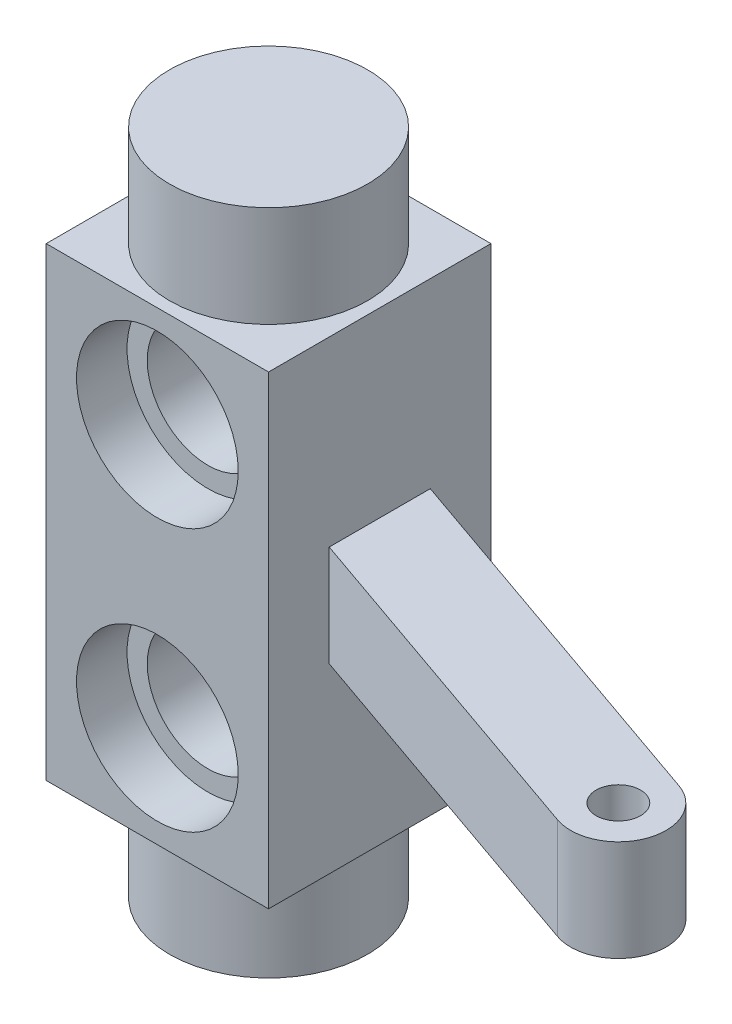
ISO-10303-21;
HEADER;
FILE_DESCRIPTION(('STEP AP214'),'2;1');
FILE_NAME('part.step','',(''),(''),'','','');
FILE_SCHEMA(('AUTOMOTIVE_DESIGN { 1 0 10303 214 1 1 1 1 }'));
ENDSEC;
DATA;
#1=APPLICATION_CONTEXT('core data for automotive mechanical design processes');
#2=APPLICATION_PROTOCOL_DEFINITION('international standard','automotive_design',2000,#1);
#3=PRODUCT_CONTEXT('',#1,'mechanical');
#4=PRODUCT('Part','Part','',(#3));
#5=PRODUCT_RELATED_PRODUCT_CATEGORY('part','',(#4));
#6=PRODUCT_DEFINITION_FORMATION('','',#4);
#7=PRODUCT_DEFINITION_CONTEXT('part definition',#1,'design');
#8=PRODUCT_DEFINITION('design','',#6,#7);
#9=PRODUCT_DEFINITION_SHAPE('','',#8);
#10=(LENGTH_UNIT() NAMED_UNIT(*) SI_UNIT(.MILLI.,.METRE.));
#11=(NAMED_UNIT(*) PLANE_ANGLE_UNIT() SI_UNIT($,.RADIAN.));
#12=(NAMED_UNIT(*) SI_UNIT($,.STERADIAN.) SOLID_ANGLE_UNIT());
#13=UNCERTAINTY_MEASURE_WITH_UNIT(LENGTH_MEASURE(1.E-05),#10,'distance_accuracy_value','');
#14=(GEOMETRIC_REPRESENTATION_CONTEXT(3) GLOBAL_UNCERTAINTY_ASSIGNED_CONTEXT((#13)) GLOBAL_UNIT_ASSIGNED_CONTEXT((#10,
#11,#12)) REPRESENTATION_CONTEXT('',''));
#15=CARTESIAN_POINT('',(0.,0.,0.));
#16=DIRECTION('',(0.,0.,1.));
#17=DIRECTION('',(1.,0.,0.));
#18=AXIS2_PLACEMENT_3D('',#15,#16,#17);
#19=CARTESIAN_POINT('',(5.5,28.,5.5));
#20=DIRECTION('',(-1.,0.,0.));
#21=DIRECTION('',(0.,0.,1.));
#22=AXIS2_PLACEMENT_3D('',#19,#20,#21);
#23=PLANE('',#22);
#24=DIRECTION('',(0.,0.,-1.));
#25=VECTOR('',#24,1.);
#26=CARTESIAN_POINT('',(5.5,5.,5.5));
#27=LINE('',#26,#25);
#28=CARTESIAN_POINT('',(5.5,5.,5.5));
#29=VERTEX_POINT('',#28);
#30=CARTESIAN_POINT('',(5.5,5.,-5.5));
#31=VERTEX_POINT('',#30);
#32=EDGE_CURVE('E183',#29,#31,#27,.T.);
#33=ORIENTED_EDGE('',*,*,#32,.T.);
#34=DIRECTION('',(0.,-1.,0.));
#35=VECTOR('',#34,1.);
#36=CARTESIAN_POINT('',(5.5,28.,-5.5));
#37=LINE('',#36,#35);
#38=CARTESIAN_POINT('',(5.5,28.,-5.5));
#39=VERTEX_POINT('',#38);
#40=EDGE_CURVE('E218',#39,#31,#37,.T.);
#41=ORIENTED_EDGE('',*,*,#40,.F.);
#42=DIRECTION('',(0.,0.,-1.));
#43=VECTOR('',#42,1.);
#44=CARTESIAN_POINT('',(5.5,28.,5.5));
#45=LINE('',#44,#43);
#46=CARTESIAN_POINT('',(5.5,28.,5.5));
#47=VERTEX_POINT('',#46);
#48=EDGE_CURVE('E187',#47,#39,#45,.T.);
#49=ORIENTED_EDGE('',*,*,#48,.F.);
#50=DIRECTION('',(0.,-1.,0.));
#51=VECTOR('',#50,1.);
#52=CARTESIAN_POINT('',(5.5,28.,5.5));
#53=LINE('',#52,#51);
#54=EDGE_CURVE('E197',#47,#29,#53,.T.);
#55=ORIENTED_EDGE('',*,*,#54,.T.);
#56=EDGE_LOOP('',(#33,#41,#49,#55));
#57=FACE_BOUND('',#56,.T.);
#58=DIRECTION('',(0.,0.,-1.));
#59=VECTOR('',#58,1.);
#60=CARTESIAN_POINT('',(5.5,14.,0.));
#61=LINE('',#60,#59);
#62=CARTESIAN_POINT('',(5.5,14.,2.5));
#63=VERTEX_POINT('',#62);
#64=CARTESIAN_POINT('',(5.5,14.,-2.5));
#65=VERTEX_POINT('',#64);
#66=EDGE_CURVE('E63',#63,#65,#61,.T.);
#67=ORIENTED_EDGE('',*,*,#66,.F.);
#68=DIRECTION('',(0.,-1.,0.));
#69=VECTOR('',#68,1.);
#70=CARTESIAN_POINT('',(5.5,19.,2.5));
#71=LINE('',#70,#69);
#72=CARTESIAN_POINT('',(5.5,19.,2.5));
#73=VERTEX_POINT('',#72);
#74=EDGE_CURVE('E365',#73,#63,#71,.T.);
#75=ORIENTED_EDGE('',*,*,#74,.F.);
#76=DIRECTION('',(0.,0.,-1.));
#77=VECTOR('',#76,1.);
#78=CARTESIAN_POINT('',(5.5,19.,0.));
#79=LINE('',#78,#77);
#80=CARTESIAN_POINT('',(5.5,19.,-2.5));
#81=VERTEX_POINT('',#80);
#82=EDGE_CURVE('E143',#73,#81,#79,.T.);
#83=ORIENTED_EDGE('',*,*,#82,.T.);
#84=DIRECTION('',(0.,-1.,0.));
#85=VECTOR('',#84,1.);
#86=CARTESIAN_POINT('',(5.5,19.,-2.5));
#87=LINE('',#86,#85);
#88=EDGE_CURVE('E159',#81,#65,#87,.T.);
#89=ORIENTED_EDGE('',*,*,#88,.T.);
#90=EDGE_LOOP('',(#67,#75,#83,#89));
#91=FACE_BOUND('',#90,.T.);
#92=ADVANCED_FACE('F45',(#57,#91),#23,.F.);
#93=CARTESIAN_POINT('',(0.,5.,0.));
#94=DIRECTION('',(0.,-1.,0.));
#95=DIRECTION('',(0.,0.,-1.));
#96=AXIS2_PLACEMENT_3D('',#93,#94,#95);
#97=CYLINDRICAL_SURFACE('',#96,4.9);
#98=CARTESIAN_POINT('',(0.,5.,0.));
#99=DIRECTION('',(0.,1.,0.));
#100=DIRECTION('',(0.,0.,1.));
#101=AXIS2_PLACEMENT_3D('',#98,#99,#100);
#102=CIRCLE('',#101,4.9);
#103=CARTESIAN_POINT('',(0.,5.,4.9));
#104=VERTEX_POINT('',#103);
#105=EDGE_CURVE('E55',#104,#104,#102,.T.);
#106=ORIENTED_EDGE('',*,*,#105,.F.);
#107=EDGE_LOOP('',(#106));
#108=FACE_BOUND('',#107,.T.);
#109=CARTESIAN_POINT('',(0.,0.,0.));
#110=DIRECTION('',(0.,1.,0.));
#111=DIRECTION('',(0.,0.,1.));
#112=AXIS2_PLACEMENT_3D('',#109,#110,#111);
#113=CIRCLE('',#112,4.9);
#114=CARTESIAN_POINT('',(0.,0.,4.9));
#115=VERTEX_POINT('',#114);
#116=EDGE_CURVE('E49',#115,#115,#113,.T.);
#117=ORIENTED_EDGE('',*,*,#116,.T.);
#118=EDGE_LOOP('',(#117));
#119=FACE_BOUND('',#118,.T.);
#120=ADVANCED_FACE('F47',(#108,#119),#97,.T.);
#121=CARTESIAN_POINT('',(0.,0.,0.));
#122=DIRECTION('',(0.,1.,0.));
#123=DIRECTION('',(0.,0.,1.));
#124=AXIS2_PLACEMENT_3D('',#121,#122,#123);
#125=PLANE('',#124);
#126=ORIENTED_EDGE('',*,*,#116,.F.);
#127=EDGE_LOOP('',(#126));
#128=FACE_BOUND('',#127,.T.);
#129=ADVANCED_FACE('F229',(#128),#125,.F.);
#130=CARTESIAN_POINT('',(-5.5,28.,-5.5));
#131=DIRECTION('',(0.,0.,1.));
#132=DIRECTION('',(1.,0.,0.));
#133=AXIS2_PLACEMENT_3D('',#130,#131,#132);
#134=PLANE('',#133);
#135=CARTESIAN_POINT('',(0.,23.,-5.5));
#136=DIRECTION('',(0.,0.,1.));
#137=DIRECTION('',(-1.,0.,0.));
#138=AXIS2_PLACEMENT_3D('',#135,#136,#137);
#139=CIRCLE('',#138,4.);
#140=CARTESIAN_POINT('',(-4.,23.,-5.5));
#141=VERTEX_POINT('',#140);
#142=EDGE_CURVE('E339',#141,#141,#139,.T.);
#143=ORIENTED_EDGE('',*,*,#142,.T.);
#144=EDGE_LOOP('',(#143));
#145=FACE_BOUND('',#144,.T.);
#146=CARTESIAN_POINT('',(0.,10.,-5.5));
#147=DIRECTION('',(0.,0.,-1.));
#148=DIRECTION('',(-1.,0.,0.));
#149=AXIS2_PLACEMENT_3D('',#146,#147,#148);
#150=CIRCLE('',#149,4.);
#151=CARTESIAN_POINT('',(-4.,10.,-5.5));
#152=VERTEX_POINT('',#151);
#153=EDGE_CURVE('E167',#152,#152,#150,.T.);
#154=ORIENTED_EDGE('',*,*,#153,.F.);
#155=EDGE_LOOP('',(#154));
#156=FACE_BOUND('',#155,.T.);
#157=DIRECTION('',(-1.,0.,0.));
#158=VECTOR('',#157,1.);
#159=CARTESIAN_POINT('',(-5.5,5.,-5.5));
#160=LINE('',#159,#158);
#161=CARTESIAN_POINT('',(-5.5,5.,-5.5));
#162=VERTEX_POINT('',#161);
#163=EDGE_CURVE('E201',#31,#162,#160,.T.);
#164=ORIENTED_EDGE('',*,*,#163,.T.);
#165=DIRECTION('',(0.,-1.,0.));
#166=VECTOR('',#165,1.);
#167=CARTESIAN_POINT('',(-5.5,28.,-5.5));
#168=LINE('',#167,#166);
#169=CARTESIAN_POINT('',(-5.5,28.,-5.5));
#170=VERTEX_POINT('',#169);
#171=EDGE_CURVE('E214',#170,#162,#168,.T.);
#172=ORIENTED_EDGE('',*,*,#171,.F.);
#173=DIRECTION('',(-1.,0.,0.));
#174=VECTOR('',#173,1.);
#175=CARTESIAN_POINT('',(-5.5,28.,-5.5));
#176=LINE('',#175,#174);
#177=EDGE_CURVE('E101',#39,#170,#176,.T.);
#178=ORIENTED_EDGE('',*,*,#177,.F.);
#179=ORIENTED_EDGE('',*,*,#40,.T.);
#180=EDGE_LOOP('',(#164,#172,#178,#179));
#181=FACE_BOUND('',#180,.T.);
#182=ADVANCED_FACE('F231',(#145,#156,#181),#134,.F.);
#183=CARTESIAN_POINT('',(-5.5,28.,5.5));
#184=DIRECTION('',(1.,0.,0.));
#185=DIRECTION('',(0.,0.,-1.));
#186=AXIS2_PLACEMENT_3D('',#183,#184,#185);
#187=PLANE('',#186);
#188=DIRECTION('',(0.,0.,1.));
#189=VECTOR('',#188,1.);
#190=CARTESIAN_POINT('',(-5.5,5.,5.5));
#191=LINE('',#190,#189);
#192=CARTESIAN_POINT('',(-5.5,5.,5.5));
#193=VERTEX_POINT('',#192);
#194=EDGE_CURVE('E204',#162,#193,#191,.T.);
#195=ORIENTED_EDGE('',*,*,#194,.T.);
#196=DIRECTION('',(0.,-1.,0.));
#197=VECTOR('',#196,1.);
#198=CARTESIAN_POINT('',(-5.5,28.,5.5));
#199=LINE('',#198,#197);
#200=CARTESIAN_POINT('',(-5.5,28.,5.5));
#201=VERTEX_POINT('',#200);
#202=EDGE_CURVE('E211',#201,#193,#199,.T.);
#203=ORIENTED_EDGE('',*,*,#202,.F.);
#204=DIRECTION('',(0.,0.,1.));
#205=VECTOR('',#204,1.);
#206=CARTESIAN_POINT('',(-5.5,28.,5.5));
#207=LINE('',#206,#205);
#208=EDGE_CURVE('E192',#170,#201,#207,.T.);
#209=ORIENTED_EDGE('',*,*,#208,.F.);
#210=ORIENTED_EDGE('',*,*,#171,.T.);
#211=EDGE_LOOP('',(#195,#203,#209,#210));
#212=FACE_BOUND('',#211,.T.);
#213=ADVANCED_FACE('F236',(#212),#187,.F.);
#214=CARTESIAN_POINT('',(-5.5,28.,5.5));
#215=DIRECTION('',(0.,0.,-1.));
#216=DIRECTION('',(-1.,0.,0.));
#217=AXIS2_PLACEMENT_3D('',#214,#215,#216);
#218=PLANE('',#217);
#219=CARTESIAN_POINT('',(0.,23.,5.5));
#220=DIRECTION('',(0.,0.,-1.));
#221=DIRECTION('',(1.,0.,0.));
#222=AXIS2_PLACEMENT_3D('',#219,#220,#221);
#223=CIRCLE('',#222,4.);
#224=CARTESIAN_POINT('',(4.,23.,5.5));
#225=VERTEX_POINT('',#224);
#226=EDGE_CURVE('E346',#225,#225,#223,.T.);
#227=ORIENTED_EDGE('',*,*,#226,.T.);
#228=EDGE_LOOP('',(#227));
#229=FACE_BOUND('',#228,.T.);
#230=CARTESIAN_POINT('',(0.,10.,5.5));
#231=DIRECTION('',(0.,0.,1.));
#232=DIRECTION('',(1.,0.,0.));
#233=AXIS2_PLACEMENT_3D('',#230,#231,#232);
#234=CIRCLE('',#233,4.);
#235=CARTESIAN_POINT('',(4.,10.,5.5));
#236=VERTEX_POINT('',#235);
#237=EDGE_CURVE('E175',#236,#236,#234,.T.);
#238=ORIENTED_EDGE('',*,*,#237,.F.);
#239=EDGE_LOOP('',(#238));
#240=FACE_BOUND('',#239,.T.);
#241=DIRECTION('',(1.,0.,0.));
#242=VECTOR('',#241,1.);
#243=CARTESIAN_POINT('',(-5.5,5.,5.5));
#244=LINE('',#243,#242);
#245=EDGE_CURVE('E93',#193,#29,#244,.T.);
#246=ORIENTED_EDGE('',*,*,#245,.T.);
#247=ORIENTED_EDGE('',*,*,#54,.F.);
#248=DIRECTION('',(1.,0.,0.));
#249=VECTOR('',#248,1.);
#250=CARTESIAN_POINT('',(-5.5,28.,5.5));
#251=LINE('',#250,#249);
#252=EDGE_CURVE('E72',#201,#47,#251,.T.);
#253=ORIENTED_EDGE('',*,*,#252,.F.);
#254=ORIENTED_EDGE('',*,*,#202,.T.);
#255=EDGE_LOOP('',(#246,#247,#253,#254));
#256=FACE_BOUND('',#255,.T.);
#257=ADVANCED_FACE('F249',(#229,#240,#256),#218,.F.);
#258=CARTESIAN_POINT('',(0.,28.,0.));
#259=DIRECTION('',(0.,-1.,0.));
#260=DIRECTION('',(0.,0.,-1.));
#261=AXIS2_PLACEMENT_3D('',#258,#259,#260);
#262=PLANE('',#261);
#263=CARTESIAN_POINT('',(0.,28.,0.));
#264=DIRECTION('',(0.,1.,0.));
#265=DIRECTION('',(0.,0.,1.));
#266=AXIS2_PLACEMENT_3D('',#263,#264,#265);
#267=CIRCLE('',#266,4.9);
#268=CARTESIAN_POINT('',(0.,28.,4.9));
#269=VERTEX_POINT('',#268);
#270=EDGE_CURVE('E11',#269,#269,#267,.T.);
#271=ORIENTED_EDGE('',*,*,#270,.F.);
#272=EDGE_LOOP('',(#271));
#273=FACE_BOUND('',#272,.T.);
#274=ORIENTED_EDGE('',*,*,#48,.T.);
#275=ORIENTED_EDGE('',*,*,#177,.T.);
#276=ORIENTED_EDGE('',*,*,#208,.T.);
#277=ORIENTED_EDGE('',*,*,#252,.T.);
#278=EDGE_LOOP('',(#274,#275,#276,#277));
#279=FACE_BOUND('',#278,.T.);
#280=ADVANCED_FACE('F253',(#273,#279),#262,.F.);
#281=CARTESIAN_POINT('',(0.,5.,0.));
#282=DIRECTION('',(0.,-1.,0.));
#283=DIRECTION('',(0.,0.,-1.));
#284=AXIS2_PLACEMENT_3D('',#281,#282,#283);
#285=PLANE('',#284);
#286=ORIENTED_EDGE('',*,*,#105,.T.);
#287=EDGE_LOOP('',(#286));
#288=FACE_BOUND('',#287,.T.);
#289=ORIENTED_EDGE('',*,*,#32,.F.);
#290=ORIENTED_EDGE('',*,*,#245,.F.);
#291=ORIENTED_EDGE('',*,*,#194,.F.);
#292=ORIENTED_EDGE('',*,*,#163,.F.);
#293=EDGE_LOOP('',(#289,#290,#291,#292));
#294=FACE_BOUND('',#293,.T.);
#295=ADVANCED_FACE('F255',(#288,#294),#285,.T.);
#296=CARTESIAN_POINT('',(0.,10.,3.));
#297=DIRECTION('',(0.,0.,1.));
#298=DIRECTION('',(1.,0.,0.));
#299=AXIS2_PLACEMENT_3D('',#296,#297,#298);
#300=CYLINDRICAL_SURFACE('',#299,4.);
#301=CARTESIAN_POINT('',(0.,10.,3.));
#302=DIRECTION('',(0.,0.,1.));
#303=DIRECTION('',(1.,0.,0.));
#304=AXIS2_PLACEMENT_3D('',#301,#302,#303);
#305=CIRCLE('',#304,4.);
#306=CARTESIAN_POINT('',(4.,10.,3.));
#307=VERTEX_POINT('',#306);
#308=EDGE_CURVE('E179',#307,#307,#305,.T.);
#309=ORIENTED_EDGE('',*,*,#308,.F.);
#310=EDGE_LOOP('',(#309));
#311=FACE_BOUND('',#310,.T.);
#312=ORIENTED_EDGE('',*,*,#237,.T.);
#313=EDGE_LOOP('',(#312));
#314=FACE_BOUND('',#313,.T.);
#315=ADVANCED_FACE('F258',(#311,#314),#300,.F.);
#316=CARTESIAN_POINT('',(0.,10.,3.));
#317=DIRECTION('',(0.,0.,1.));
#318=DIRECTION('',(1.,0.,0.));
#319=AXIS2_PLACEMENT_3D('',#316,#317,#318);
#320=PLANE('',#319);
#321=CARTESIAN_POINT('',(0.,10.,3.));
#322=DIRECTION('',(0.,0.,1.));
#323=DIRECTION('',(1.,0.,0.));
#324=AXIS2_PLACEMENT_3D('',#321,#322,#323);
#325=CIRCLE('',#324,3.);
#326=CARTESIAN_POINT('',(3.,10.,3.));
#327=VERTEX_POINT('',#326);
#328=EDGE_CURVE('E157',#327,#327,#325,.F.);
#329=ORIENTED_EDGE('',*,*,#328,.T.);
#330=EDGE_LOOP('',(#329));
#331=FACE_BOUND('',#330,.T.);
#332=ORIENTED_EDGE('',*,*,#308,.T.);
#333=EDGE_LOOP('',(#332));
#334=FACE_BOUND('',#333,.T.);
#335=ADVANCED_FACE('F264',(#331,#334),#320,.T.);
#336=CARTESIAN_POINT('',(0.,10.,-3.));
#337=DIRECTION('',(0.,0.,-1.));
#338=DIRECTION('',(-1.,0.,0.));
#339=AXIS2_PLACEMENT_3D('',#336,#337,#338);
#340=CYLINDRICAL_SURFACE('',#339,4.);
#341=CARTESIAN_POINT('',(0.,10.,-3.));
#342=DIRECTION('',(0.,0.,-1.));
#343=DIRECTION('',(-1.,0.,0.));
#344=AXIS2_PLACEMENT_3D('',#341,#342,#343);
#345=CIRCLE('',#344,4.);
#346=CARTESIAN_POINT('',(-4.,10.,-3.));
#347=VERTEX_POINT('',#346);
#348=EDGE_CURVE('E171',#347,#347,#345,.T.);
#349=ORIENTED_EDGE('',*,*,#348,.F.);
#350=EDGE_LOOP('',(#349));
#351=FACE_BOUND('',#350,.T.);
#352=ORIENTED_EDGE('',*,*,#153,.T.);
#353=EDGE_LOOP('',(#352));
#354=FACE_BOUND('',#353,.T.);
#355=ADVANCED_FACE('F268',(#351,#354),#340,.F.);
#356=CARTESIAN_POINT('',(0.,10.,-3.));
#357=DIRECTION('',(0.,0.,-1.));
#358=DIRECTION('',(-1.,0.,0.));
#359=AXIS2_PLACEMENT_3D('',#356,#357,#358);
#360=PLANE('',#359);
#361=CARTESIAN_POINT('',(0.,10.,-3.));
#362=DIRECTION('',(0.,0.,-1.));
#363=DIRECTION('',(-1.,0.,0.));
#364=AXIS2_PLACEMENT_3D('',#361,#362,#363);
#365=CIRCLE('',#364,3.);
#366=CARTESIAN_POINT('',(-3.,10.,-3.));
#367=VERTEX_POINT('',#366);
#368=EDGE_CURVE('E163',#367,#367,#365,.T.);
#369=ORIENTED_EDGE('',*,*,#368,.F.);
#370=EDGE_LOOP('',(#369));
#371=FACE_BOUND('',#370,.T.);
#372=ORIENTED_EDGE('',*,*,#348,.T.);
#373=EDGE_LOOP('',(#372));
#374=FACE_BOUND('',#373,.T.);
#375=ADVANCED_FACE('F272',(#371,#374),#360,.T.);
#376=CARTESIAN_POINT('',(0.,10.,5.501));
#377=DIRECTION('',(0.,0.,-1.));
#378=DIRECTION('',(-1.,0.,0.));
#379=AXIS2_PLACEMENT_3D('',#376,#377,#378);
#380=CYLINDRICAL_SURFACE('',#379,3.);
#381=ORIENTED_EDGE('',*,*,#328,.F.);
#382=EDGE_LOOP('',(#381));
#383=FACE_BOUND('',#382,.T.);
#384=ORIENTED_EDGE('',*,*,#368,.T.);
#385=EDGE_LOOP('',(#384));
#386=FACE_BOUND('',#385,.T.);
#387=ADVANCED_FACE('F276',(#383,#386),#380,.F.);
#388=CARTESIAN_POINT('',(0.,33.,0.));
#389=DIRECTION('',(0.,-1.,0.));
#390=DIRECTION('',(0.,0.,-1.));
#391=AXIS2_PLACEMENT_3D('',#388,#389,#390);
#392=CYLINDRICAL_SURFACE('',#391,4.9);
#393=CARTESIAN_POINT('',(0.,33.,0.));
#394=DIRECTION('',(0.,1.,0.));
#395=DIRECTION('',(0.,0.,1.));
#396=AXIS2_PLACEMENT_3D('',#393,#394,#395);
#397=CIRCLE('',#396,4.9);
#398=CARTESIAN_POINT('',(0.,33.,4.9));
#399=VERTEX_POINT('',#398);
#400=EDGE_CURVE('E152',#399,#399,#397,.T.);
#401=ORIENTED_EDGE('',*,*,#400,.F.);
#402=EDGE_LOOP('',(#401));
#403=FACE_BOUND('',#402,.T.);
#404=ORIENTED_EDGE('',*,*,#270,.T.);
#405=EDGE_LOOP('',(#404));
#406=FACE_BOUND('',#405,.T.);
#407=ADVANCED_FACE('F280',(#403,#406),#392,.T.);
#408=CARTESIAN_POINT('',(0.,33.,0.));
#409=DIRECTION('',(0.,1.,0.));
#410=DIRECTION('',(0.,0.,1.));
#411=AXIS2_PLACEMENT_3D('',#408,#409,#410);
#412=PLANE('',#411);
#413=ORIENTED_EDGE('',*,*,#400,.T.);
#414=EDGE_LOOP('',(#413));
#415=FACE_BOUND('',#414,.T.);
#416=ADVANCED_FACE('F284',(#415),#412,.T.);
#417=CARTESIAN_POINT('',(-0.181538262045484,19.,0.52124529630105));
#418=DIRECTION('',(0.328901297514578,0.,-0.944364302847808));
#419=DIRECTION('',(-0.944364302847808,0.,-0.328901297514578));
#420=AXIS2_PLACEMENT_3D('',#417,#418,#419);
#421=PLANE('',#420);
#422=DIRECTION('',(0.944364302847808,0.,0.328901297514578));
#423=VECTOR('',#422,1.);
#424=CARTESIAN_POINT('',(-0.181538262045484,14.,0.52124529630105));
#425=LINE('',#424,#423);
#426=CARTESIAN_POINT('',(22.8342728342907,14.,8.53714563275769));
#427=VERTEX_POINT('',#426);
#428=EDGE_CURVE('E150',#63,#427,#425,.T.);
#429=ORIENTED_EDGE('',*,*,#428,.T.);
#430=DIRECTION('',(0.,-1.,0.));
#431=VECTOR('',#430,1.);
#432=CARTESIAN_POINT('',(22.8342728342907,19.,8.53714563275769));
#433=LINE('',#432,#431);
#434=CARTESIAN_POINT('',(22.8342728342907,19.,8.53714563275769));
#435=VERTEX_POINT('',#434);
#436=EDGE_CURVE('E130',#435,#427,#433,.T.);
#437=ORIENTED_EDGE('',*,*,#436,.F.);
#438=DIRECTION('',(0.944364302847808,0.,0.328901297514578));
#439=VECTOR('',#438,1.);
#440=CARTESIAN_POINT('',(-0.181538262045484,19.,0.52124529630105));
#441=LINE('',#440,#439);
#442=EDGE_CURVE('E138',#73,#435,#441,.T.);
#443=ORIENTED_EDGE('',*,*,#442,.F.);
#444=ORIENTED_EDGE('',*,*,#74,.T.);
#445=EDGE_LOOP('',(#429,#437,#443,#444));
#446=FACE_BOUND('',#445,.T.);
#447=ADVANCED_FACE('F149',(#446),#421,.F.);
#448=CARTESIAN_POINT('',(23.6107794456234,19.,6.30758579152463));
#449=DIRECTION('',(0.,-1.,0.));
#450=DIRECTION('',(0.,0.,-1.));
#451=AXIS2_PLACEMENT_3D('',#448,#449,#450);
#452=CYLINDRICAL_SURFACE('',#451,2.36091075711952);
#453=CARTESIAN_POINT('',(23.6107794456234,14.,6.30758579152463));
#454=DIRECTION('',(0.,1.,0.));
#455=DIRECTION('',(0.,0.,1.));
#456=AXIS2_PLACEMENT_3D('',#453,#454,#455);
#457=CIRCLE('',#456,2.36091075711952);
#458=CARTESIAN_POINT('',(24.3872860569562,14.,4.07802595029156));
#459=VERTEX_POINT('',#458);
#460=EDGE_CURVE('E371',#427,#459,#457,.T.);
#461=ORIENTED_EDGE('',*,*,#460,.T.);
#462=DIRECTION('',(0.,-1.,0.));
#463=VECTOR('',#462,1.);
#464=CARTESIAN_POINT('',(24.3872860569562,19.,4.07802595029156));
#465=LINE('',#464,#463);
#466=CARTESIAN_POINT('',(24.3872860569562,19.,4.07802595029156));
#467=VERTEX_POINT('',#466);
#468=EDGE_CURVE('E132',#467,#459,#465,.T.);
#469=ORIENTED_EDGE('',*,*,#468,.F.);
#470=CARTESIAN_POINT('',(23.6107794456234,19.,6.30758579152463));
#471=DIRECTION('',(0.,1.,0.));
#472=DIRECTION('',(0.,0.,1.));
#473=AXIS2_PLACEMENT_3D('',#470,#471,#472);
#474=CIRCLE('',#473,2.36091075711952);
#475=EDGE_CURVE('E125',#435,#467,#474,.T.);
#476=ORIENTED_EDGE('',*,*,#475,.F.);
#477=ORIENTED_EDGE('',*,*,#436,.T.);
#478=EDGE_LOOP('',(#461,#469,#476,#477));
#479=FACE_BOUND('',#478,.T.);
#480=ADVANCED_FACE('F128',(#479),#452,.T.);
#481=CARTESIAN_POINT('',(1.37147496061999,19.,-3.93787438616509));
#482=DIRECTION('',(0.328901297514578,0.,-0.944364302847808));
#483=DIRECTION('',(-0.944364302847808,0.,-0.328901297514578));
#484=AXIS2_PLACEMENT_3D('',#481,#482,#483);
#485=PLANE('',#484);
#486=DIRECTION('',(0.944364302847808,0.,0.328901297514578));
#487=VECTOR('',#486,1.);
#488=CARTESIAN_POINT('',(1.37147496061999,14.,-3.93787438616509));
#489=LINE('',#488,#487);
#490=EDGE_CURVE('E374',#65,#459,#489,.T.);
#491=ORIENTED_EDGE('',*,*,#490,.F.);
#492=ORIENTED_EDGE('',*,*,#88,.F.);
#493=DIRECTION('',(0.944364302847808,0.,0.328901297514578));
#494=VECTOR('',#493,1.);
#495=CARTESIAN_POINT('',(1.37147496061999,19.,-3.93787438616509));
#496=LINE('',#495,#494);
#497=EDGE_CURVE('E137',#81,#467,#496,.T.);
#498=ORIENTED_EDGE('',*,*,#497,.T.);
#499=ORIENTED_EDGE('',*,*,#468,.T.);
#500=EDGE_LOOP('',(#491,#492,#498,#499));
#501=FACE_BOUND('',#500,.T.);
#502=ADVANCED_FACE('F292',(#501),#485,.T.);
#503=CARTESIAN_POINT('',(23.6107794456234,19.,6.30758579152463));
#504=DIRECTION('',(0.,-1.,0.));
#505=DIRECTION('',(0.,0.,-1.));
#506=AXIS2_PLACEMENT_3D('',#503,#504,#505);
#507=CYLINDRICAL_SURFACE('',#506,1.1);
#508=CARTESIAN_POINT('',(23.6107794456234,19.,6.30758579152463));
#509=DIRECTION('',(0.,1.,0.));
#510=DIRECTION('',(0.,0.,1.));
#511=AXIS2_PLACEMENT_3D('',#508,#509,#510);
#512=CIRCLE('',#511,1.1);
#513=CARTESIAN_POINT('',(23.6107794456234,19.,7.40758579152463));
#514=VERTEX_POINT('',#513);
#515=EDGE_CURVE('E147',#514,#514,#512,.T.);
#516=ORIENTED_EDGE('',*,*,#515,.T.);
#517=EDGE_LOOP('',(#516));
#518=FACE_BOUND('',#517,.T.);
#519=CARTESIAN_POINT('',(23.6107794456234,14.,6.30758579152463));
#520=DIRECTION('',(0.,1.,0.));
#521=DIRECTION('',(0.,0.,1.));
#522=AXIS2_PLACEMENT_3D('',#519,#520,#521);
#523=CIRCLE('',#522,1.1);
#524=CARTESIAN_POINT('',(23.6107794456234,14.,7.40758579152463));
#525=VERTEX_POINT('',#524);
#526=EDGE_CURVE('E354',#525,#525,#523,.T.);
#527=ORIENTED_EDGE('',*,*,#526,.F.);
#528=EDGE_LOOP('',(#527));
#529=FACE_BOUND('',#528,.T.);
#530=ADVANCED_FACE('F289',(#518,#529),#507,.F.);
#531=CARTESIAN_POINT('',(0.,19.,0.));
#532=DIRECTION('',(0.,1.,0.));
#533=DIRECTION('',(0.,0.,1.));
#534=AXIS2_PLACEMENT_3D('',#531,#532,#533);
#535=PLANE('',#534);
#536=ORIENTED_EDGE('',*,*,#515,.F.);
#537=EDGE_LOOP('',(#536));
#538=FACE_BOUND('',#537,.T.);
#539=ORIENTED_EDGE('',*,*,#442,.T.);
#540=ORIENTED_EDGE('',*,*,#475,.T.);
#541=ORIENTED_EDGE('',*,*,#497,.F.);
#542=ORIENTED_EDGE('',*,*,#82,.F.);
#543=EDGE_LOOP('',(#539,#540,#541,#542));
#544=FACE_BOUND('',#543,.T.);
#545=ADVANCED_FACE('F141',(#538,#544),#535,.T.);
#546=CARTESIAN_POINT('',(0.,14.,0.));
#547=DIRECTION('',(0.,1.,0.));
#548=DIRECTION('',(0.,0.,1.));
#549=AXIS2_PLACEMENT_3D('',#546,#547,#548);
#550=PLANE('',#549);
#551=ORIENTED_EDGE('',*,*,#526,.T.);
#552=EDGE_LOOP('',(#551));
#553=FACE_BOUND('',#552,.T.);
#554=ORIENTED_EDGE('',*,*,#428,.F.);
#555=ORIENTED_EDGE('',*,*,#66,.T.);
#556=ORIENTED_EDGE('',*,*,#490,.T.);
#557=ORIENTED_EDGE('',*,*,#460,.F.);
#558=EDGE_LOOP('',(#554,#555,#556,#557));
#559=FACE_BOUND('',#558,.T.);
#560=ADVANCED_FACE('F301',(#553,#559),#550,.F.);
#561=CARTESIAN_POINT('',(0.,23.,3.));
#562=DIRECTION('',(0.,0.,1.));
#563=DIRECTION('',(1.,0.,0.));
#564=AXIS2_PLACEMENT_3D('',#561,#562,#563);
#565=CYLINDRICAL_SURFACE('',#564,4.);
#566=CARTESIAN_POINT('',(0.,23.,3.));
#567=DIRECTION('',(0.,0.,-1.));
#568=DIRECTION('',(1.,0.,0.));
#569=AXIS2_PLACEMENT_3D('',#566,#567,#568);
#570=CIRCLE('',#569,4.);
#571=CARTESIAN_POINT('',(4.,23.,3.));
#572=VERTEX_POINT('',#571);
#573=EDGE_CURVE('E350',#572,#572,#570,.T.);
#574=ORIENTED_EDGE('',*,*,#573,.T.);
#575=EDGE_LOOP('',(#574));
#576=FACE_BOUND('',#575,.T.);
#577=ORIENTED_EDGE('',*,*,#226,.F.);
#578=EDGE_LOOP('',(#577));
#579=FACE_BOUND('',#578,.T.);
#580=ADVANCED_FACE('F304',(#576,#579),#565,.F.);
#581=CARTESIAN_POINT('',(0.,23.,3.));
#582=DIRECTION('',(0.,0.,1.));
#583=DIRECTION('',(1.,0.,0.));
#584=AXIS2_PLACEMENT_3D('',#581,#582,#583);
#585=PLANE('',#584);
#586=CARTESIAN_POINT('',(0.,23.,3.));
#587=DIRECTION('',(0.,0.,1.));
#588=DIRECTION('',(1.,0.,0.));
#589=AXIS2_PLACEMENT_3D('',#586,#587,#588);
#590=CIRCLE('',#589,3.);
#591=CARTESIAN_POINT('',(3.,23.,3.));
#592=VERTEX_POINT('',#591);
#593=EDGE_CURVE('E332',#592,#592,#590,.T.);
#594=ORIENTED_EDGE('',*,*,#593,.F.);
#595=EDGE_LOOP('',(#594));
#596=FACE_BOUND('',#595,.T.);
#597=ORIENTED_EDGE('',*,*,#573,.F.);
#598=EDGE_LOOP('',(#597));
#599=FACE_BOUND('',#598,.T.);
#600=ADVANCED_FACE('F311',(#596,#599),#585,.T.);
#601=CARTESIAN_POINT('',(0.,23.,-3.));
#602=DIRECTION('',(0.,0.,-1.));
#603=DIRECTION('',(-1.,0.,0.));
#604=AXIS2_PLACEMENT_3D('',#601,#602,#603);
#605=CYLINDRICAL_SURFACE('',#604,4.);
#606=CARTESIAN_POINT('',(0.,23.,-3.));
#607=DIRECTION('',(0.,0.,1.));
#608=DIRECTION('',(-1.,0.,0.));
#609=AXIS2_PLACEMENT_3D('',#606,#607,#608);
#610=CIRCLE('',#609,4.);
#611=CARTESIAN_POINT('',(-4.,23.,-3.));
#612=VERTEX_POINT('',#611);
#613=EDGE_CURVE('E342',#612,#612,#610,.T.);
#614=ORIENTED_EDGE('',*,*,#613,.T.);
#615=EDGE_LOOP('',(#614));
#616=FACE_BOUND('',#615,.T.);
#617=ORIENTED_EDGE('',*,*,#142,.F.);
#618=EDGE_LOOP('',(#617));
#619=FACE_BOUND('',#618,.T.);
#620=ADVANCED_FACE('F315',(#616,#619),#605,.F.);
#621=CARTESIAN_POINT('',(0.,23.,-3.));
#622=DIRECTION('',(0.,0.,-1.));
#623=DIRECTION('',(-1.,0.,0.));
#624=AXIS2_PLACEMENT_3D('',#621,#622,#623);
#625=PLANE('',#624);
#626=CARTESIAN_POINT('',(0.,23.,-3.));
#627=DIRECTION('',(0.,0.,1.));
#628=DIRECTION('',(-1.,0.,0.));
#629=AXIS2_PLACEMENT_3D('',#626,#627,#628);
#630=CIRCLE('',#629,3.);
#631=CARTESIAN_POINT('',(-3.,23.,-3.));
#632=VERTEX_POINT('',#631);
#633=EDGE_CURVE('E335',#632,#632,#630,.T.);
#634=ORIENTED_EDGE('',*,*,#633,.T.);
#635=EDGE_LOOP('',(#634));
#636=FACE_BOUND('',#635,.T.);
#637=ORIENTED_EDGE('',*,*,#613,.F.);
#638=EDGE_LOOP('',(#637));
#639=FACE_BOUND('',#638,.T.);
#640=ADVANCED_FACE('F319',(#636,#639),#625,.T.);
#641=CARTESIAN_POINT('',(0.,23.,8.66949654864415));
#642=DIRECTION('',(0.,0.,-1.));
#643=DIRECTION('',(-1.,0.,0.));
#644=AXIS2_PLACEMENT_3D('',#641,#642,#643);
#645=CYLINDRICAL_SURFACE('',#644,3.);
#646=ORIENTED_EDGE('',*,*,#593,.T.);
#647=EDGE_LOOP('',(#646));
#648=FACE_BOUND('',#647,.T.);
#649=ORIENTED_EDGE('',*,*,#633,.F.);
#650=EDGE_LOOP('',(#649));
#651=FACE_BOUND('',#650,.T.);
#652=ADVANCED_FACE('F323',(#648,#651),#645,.F.);
#653=CLOSED_SHELL('',(#92,#120,#129,#182,#213,#257,#280,#295,#315,#335,#355,#375,#387,#407,#416,
#447,#480,#502,#530,#545,#560,#580,#600,#620,#640,#652));
#654=MANIFOLD_SOLID_BREP('B2',#653);
#655=ADVANCED_BREP_SHAPE_REPRESENTATION('',(#18,#654),#14);
#656=SHAPE_DEFINITION_REPRESENTATION(#9,#655);
ENDSEC;
END-ISO-10303-21;
